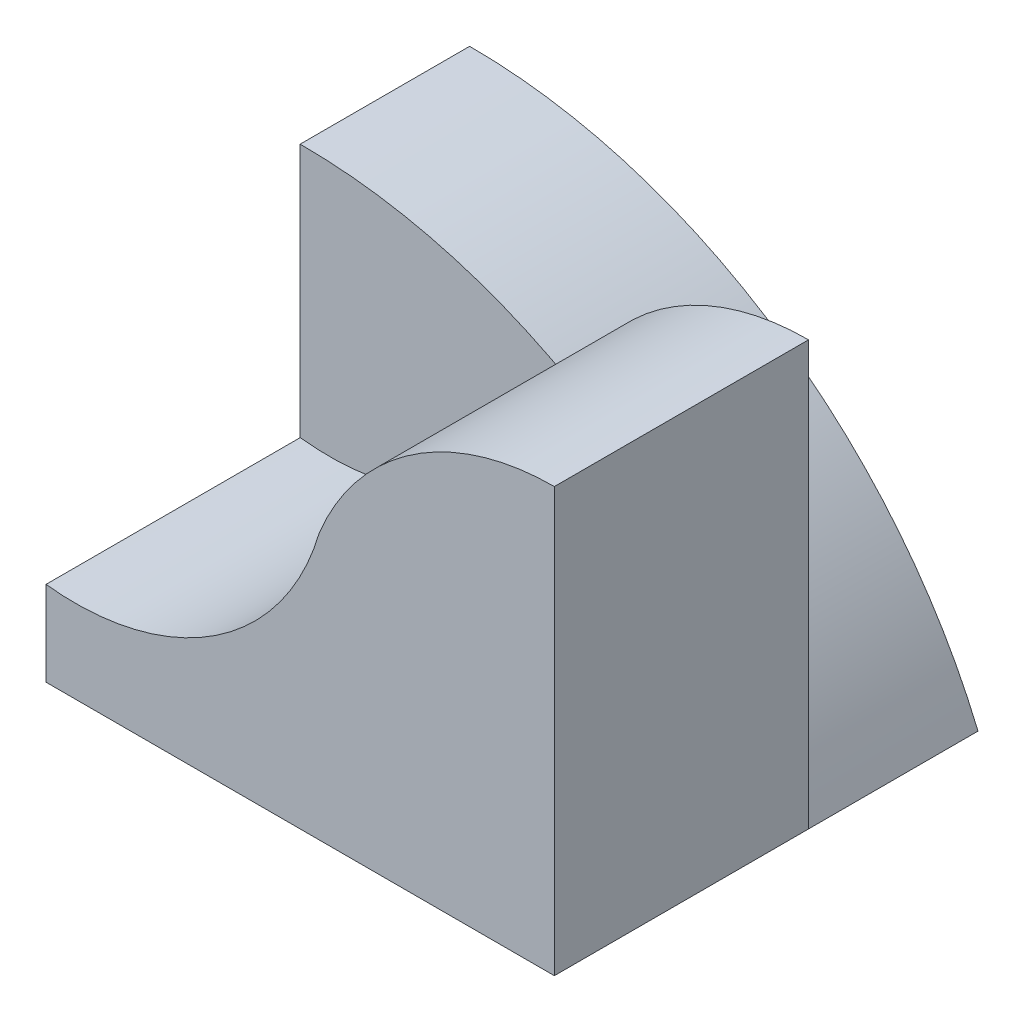
ISO-10303-21;
HEADER;
FILE_DESCRIPTION(('STEP AP214'),'2;1');
FILE_NAME('part.step','',(''),(''),'','','');
FILE_SCHEMA(('AUTOMOTIVE_DESIGN { 1 0 10303 214 1 1 1 1 }'));
ENDSEC;
DATA;
#1=APPLICATION_CONTEXT('core data for automotive mechanical design processes');
#2=APPLICATION_PROTOCOL_DEFINITION('international standard','automotive_design',2000,#1);
#3=PRODUCT_CONTEXT('',#1,'mechanical');
#4=PRODUCT('Part','Part','',(#3));
#5=PRODUCT_RELATED_PRODUCT_CATEGORY('part','',(#4));
#6=PRODUCT_DEFINITION_FORMATION('','',#4);
#7=PRODUCT_DEFINITION_CONTEXT('part definition',#1,'design');
#8=PRODUCT_DEFINITION('design','',#6,#7);
#9=PRODUCT_DEFINITION_SHAPE('','',#8);
#10=(LENGTH_UNIT() NAMED_UNIT(*) SI_UNIT(.MILLI.,.METRE.));
#11=(NAMED_UNIT(*) PLANE_ANGLE_UNIT() SI_UNIT($,.RADIAN.));
#12=(NAMED_UNIT(*) SI_UNIT($,.STERADIAN.) SOLID_ANGLE_UNIT());
#13=UNCERTAINTY_MEASURE_WITH_UNIT(LENGTH_MEASURE(1.E-05),#10,'distance_accuracy_value','');
#14=(GEOMETRIC_REPRESENTATION_CONTEXT(3) GLOBAL_UNCERTAINTY_ASSIGNED_CONTEXT((#13)) GLOBAL_UNIT_ASSIGNED_CONTEXT((#10,
#11,#12)) REPRESENTATION_CONTEXT('',''));
#15=CARTESIAN_POINT('',(0.,0.,0.));
#16=DIRECTION('',(0.,0.,1.));
#17=DIRECTION('',(1.,0.,0.));
#18=AXIS2_PLACEMENT_3D('',#15,#16,#17);
#19=CARTESIAN_POINT('',(0.,-12.5,10.));
#20=DIRECTION('',(0.,0.,-1.));
#21=DIRECTION('',(-1.,0.,0.));
#22=AXIS2_PLACEMENT_3D('',#19,#20,#21);
#23=PLANE('',#22);
#24=CARTESIAN_POINT('',(1.72698127493479,19.9002528728886,10.));
#25=DIRECTION('',(0.,0.,-1.));
#26=DIRECTION('',(-1.,0.,0.));
#27=AXIS2_PLACEMENT_3D('',#24,#25,#26);
#28=CIRCLE('',#27,15.);
#29=CARTESIAN_POINT('',(16.1310348243412,15.7141757897673,10.));
#30=VERTEX_POINT('',#29);
#31=CARTESIAN_POINT('',(0.,5.,10.));
#32=VERTEX_POINT('',#31);
#33=EDGE_CURVE('E37',#30,#32,#28,.T.);
#34=ORIENTED_EDGE('',*,*,#33,.F.);
#35=CARTESIAN_POINT('',(0.,-12.5,10.));
#36=DIRECTION('',(0.,0.,1.));
#37=DIRECTION('',(-1.,0.,0.));
#38=AXIS2_PLACEMENT_3D('',#35,#36,#37);
#39=CIRCLE('',#38,32.5);
#40=CARTESIAN_POINT('',(0.,20.,10.));
#41=VERTEX_POINT('',#40);
#42=EDGE_CURVE('E79',#30,#41,#39,.T.);
#43=ORIENTED_EDGE('',*,*,#42,.T.);
#44=DIRECTION('',(0.,-1.,0.));
#45=VECTOR('',#44,1.);
#46=CARTESIAN_POINT('',(0.,20.,10.));
#47=LINE('',#46,#45);
#48=EDGE_CURVE('E89',#41,#32,#47,.T.);
#49=ORIENTED_EDGE('',*,*,#48,.T.);
#50=EDGE_LOOP('',(#34,#43,#49));
#51=FACE_BOUND('',#50,.T.);
#52=ADVANCED_FACE('F33',(#51),#23,.F.);
#53=CARTESIAN_POINT('',(0.,-12.5,10.));
#54=DIRECTION('',(0.,0.,-1.));
#55=DIRECTION('',(-1.,0.,0.));
#56=AXIS2_PLACEMENT_3D('',#53,#54,#55);
#57=CYLINDRICAL_SURFACE('',#56,32.5);
#58=CARTESIAN_POINT('',(0.,-12.5,0.));
#59=DIRECTION('',(0.,0.,1.));
#60=DIRECTION('',(-1.,0.,0.));
#61=AXIS2_PLACEMENT_3D('',#58,#59,#60);
#62=CIRCLE('',#61,32.5);
#63=CARTESIAN_POINT('',(30.,0.,0.));
#64=VERTEX_POINT('',#63);
#65=CARTESIAN_POINT('',(0.,20.,0.));
#66=VERTEX_POINT('',#65);
#67=EDGE_CURVE('E85',#64,#66,#62,.T.);
#68=ORIENTED_EDGE('',*,*,#67,.T.);
#69=DIRECTION('',(0.,0.,-1.));
#70=VECTOR('',#69,1.);
#71=CARTESIAN_POINT('',(0.,20.,10.));
#72=LINE('',#71,#70);
#73=EDGE_CURVE('E11',#41,#66,#72,.T.);
#74=ORIENTED_EDGE('',*,*,#73,.F.);
#75=ORIENTED_EDGE('',*,*,#42,.F.);
#76=CARTESIAN_POINT('',(30.,0.,10.));
#77=VERTEX_POINT('',#76);
#78=EDGE_CURVE('E87',#77,#30,#39,.T.);
#79=ORIENTED_EDGE('',*,*,#78,.F.);
#80=DIRECTION('',(0.,0.,-1.));
#81=VECTOR('',#80,1.);
#82=CARTESIAN_POINT('',(30.,0.,10.));
#83=LINE('',#82,#81);
#84=EDGE_CURVE('E59',#77,#64,#83,.T.);
#85=ORIENTED_EDGE('',*,*,#84,.T.);
#86=EDGE_LOOP('',(#68,#74,#75,#79,#85));
#87=FACE_BOUND('',#86,.T.);
#88=ADVANCED_FACE('F35',(#87),#57,.T.);
#89=CARTESIAN_POINT('',(0.,20.,10.));
#90=DIRECTION('',(1.,0.,0.));
#91=DIRECTION('',(0.,0.,-1.));
#92=AXIS2_PLACEMENT_3D('',#89,#90,#91);
#93=PLANE('',#92);
#94=DIRECTION('',(0.,-1.,0.));
#95=VECTOR('',#94,1.);
#96=CARTESIAN_POINT('',(0.,20.,0.));
#97=LINE('',#96,#95);
#98=CARTESIAN_POINT('',(0.,0.,0.));
#99=VERTEX_POINT('',#98);
#100=EDGE_CURVE('E80',#66,#99,#97,.T.);
#101=ORIENTED_EDGE('',*,*,#100,.T.);
#102=DIRECTION('',(0.,0.,-1.));
#103=VECTOR('',#102,1.);
#104=CARTESIAN_POINT('',(0.,0.,10.));
#105=LINE('',#104,#103);
#106=CARTESIAN_POINT('',(0.,0.,25.));
#107=VERTEX_POINT('',#106);
#108=EDGE_CURVE('E43',#107,#99,#105,.T.);
#109=ORIENTED_EDGE('',*,*,#108,.F.);
#110=DIRECTION('',(0.,-1.,0.));
#111=VECTOR('',#110,1.);
#112=CARTESIAN_POINT('',(0.,5.,25.));
#113=LINE('',#112,#111);
#114=CARTESIAN_POINT('',(0.,5.,25.));
#115=VERTEX_POINT('',#114);
#116=EDGE_CURVE('E134',#115,#107,#113,.T.);
#117=ORIENTED_EDGE('',*,*,#116,.F.);
#118=DIRECTION('',(0.,0.,-1.));
#119=VECTOR('',#118,1.);
#120=CARTESIAN_POINT('',(0.,5.,25.));
#121=LINE('',#120,#119);
#122=EDGE_CURVE('E92',#115,#32,#121,.T.);
#123=ORIENTED_EDGE('',*,*,#122,.T.);
#124=ORIENTED_EDGE('',*,*,#48,.F.);
#125=ORIENTED_EDGE('',*,*,#73,.T.);
#126=EDGE_LOOP('',(#101,#109,#117,#123,#124,#125));
#127=FACE_BOUND('',#126,.T.);
#128=ADVANCED_FACE('F152',(#127),#93,.F.);
#129=CARTESIAN_POINT('',(0.,0.,10.));
#130=DIRECTION('',(0.,1.,0.));
#131=DIRECTION('',(0.,0.,1.));
#132=AXIS2_PLACEMENT_3D('',#129,#130,#131);
#133=PLANE('',#132);
#134=DIRECTION('',(1.,0.,0.));
#135=VECTOR('',#134,1.);
#136=CARTESIAN_POINT('',(0.,0.,0.));
#137=LINE('',#136,#135);
#138=EDGE_CURVE('E73',#99,#64,#137,.T.);
#139=ORIENTED_EDGE('',*,*,#138,.T.);
#140=ORIENTED_EDGE('',*,*,#84,.F.);
#141=DIRECTION('',(0.,0.,-1.));
#142=VECTOR('',#141,1.);
#143=CARTESIAN_POINT('',(30.,0.,25.));
#144=LINE('',#143,#142);
#145=CARTESIAN_POINT('',(30.,0.,25.));
#146=VERTEX_POINT('',#145);
#147=EDGE_CURVE('E96',#146,#77,#144,.T.);
#148=ORIENTED_EDGE('',*,*,#147,.F.);
#149=DIRECTION('',(1.,0.,0.));
#150=VECTOR('',#149,1.);
#151=CARTESIAN_POINT('',(0.,0.,25.));
#152=LINE('',#151,#150);
#153=EDGE_CURVE('E131',#107,#146,#152,.T.);
#154=ORIENTED_EDGE('',*,*,#153,.F.);
#155=ORIENTED_EDGE('',*,*,#108,.T.);
#156=EDGE_LOOP('',(#139,#140,#148,#154,#155));
#157=FACE_BOUND('',#156,.T.);
#158=ADVANCED_FACE('F74',(#157),#133,.F.);
#159=CARTESIAN_POINT('',(0.,-12.5,0.));
#160=DIRECTION('',(0.,0.,-1.));
#161=DIRECTION('',(-1.,0.,0.));
#162=AXIS2_PLACEMENT_3D('',#159,#160,#161);
#163=PLANE('',#162);
#164=ORIENTED_EDGE('',*,*,#67,.F.);
#165=ORIENTED_EDGE('',*,*,#138,.F.);
#166=ORIENTED_EDGE('',*,*,#100,.F.);
#167=EDGE_LOOP('',(#164,#165,#166));
#168=FACE_BOUND('',#167,.T.);
#169=ADVANCED_FACE('F91',(#168),#163,.T.);
#170=CARTESIAN_POINT('',(1.72698127493479,19.9002528728886,25.));
#171=DIRECTION('',(0.,0.,-1.));
#172=DIRECTION('',(-1.,0.,0.));
#173=AXIS2_PLACEMENT_3D('',#170,#171,#172);
#174=CYLINDRICAL_SURFACE('',#173,15.);
#175=ORIENTED_EDGE('',*,*,#33,.T.);
#176=ORIENTED_EDGE('',*,*,#122,.F.);
#177=CARTESIAN_POINT('',(1.72698127493479,19.9002528728886,25.));
#178=DIRECTION('',(0.,0.,-1.));
#179=DIRECTION('',(-1.,0.,0.));
#180=AXIS2_PLACEMENT_3D('',#177,#178,#179);
#181=CIRCLE('',#180,15.);
#182=CARTESIAN_POINT('',(16.1310348243412,15.7141757897673,25.));
#183=VERTEX_POINT('',#182);
#184=EDGE_CURVE('E121',#183,#115,#181,.T.);
#185=ORIENTED_EDGE('',*,*,#184,.F.);
#186=DIRECTION('',(0.,0.,-1.));
#187=VECTOR('',#186,1.);
#188=CARTESIAN_POINT('',(16.1310348243412,15.7141757897673,25.));
#189=LINE('',#188,#187);
#190=EDGE_CURVE('E115',#183,#30,#189,.T.);
#191=ORIENTED_EDGE('',*,*,#190,.T.);
#192=EDGE_LOOP('',(#175,#176,#185,#191));
#193=FACE_BOUND('',#192,.T.);
#194=ADVANCED_FACE('F150',(#193),#174,.F.);
#195=CARTESIAN_POINT('',(30.,0.,25.));
#196=DIRECTION('',(-1.,0.,0.));
#197=DIRECTION('',(0.,0.,1.));
#198=AXIS2_PLACEMENT_3D('',#195,#196,#197);
#199=PLANE('',#198);
#200=DIRECTION('',(0.,1.,0.));
#201=VECTOR('',#200,1.);
#202=CARTESIAN_POINT('',(30.,0.,10.));
#203=LINE('',#202,#201);
#204=CARTESIAN_POINT('',(30.,25.,10.));
#205=VERTEX_POINT('',#204);
#206=EDGE_CURVE('E122',#77,#205,#203,.T.);
#207=ORIENTED_EDGE('',*,*,#206,.T.);
#208=DIRECTION('',(0.,0.,-1.));
#209=VECTOR('',#208,1.);
#210=CARTESIAN_POINT('',(30.,25.,25.));
#211=LINE('',#210,#209);
#212=CARTESIAN_POINT('',(30.,25.,25.));
#213=VERTEX_POINT('',#212);
#214=EDGE_CURVE('E112',#213,#205,#211,.T.);
#215=ORIENTED_EDGE('',*,*,#214,.F.);
#216=DIRECTION('',(0.,1.,0.));
#217=VECTOR('',#216,1.);
#218=CARTESIAN_POINT('',(30.,0.,25.));
#219=LINE('',#218,#217);
#220=EDGE_CURVE('E128',#146,#213,#219,.T.);
#221=ORIENTED_EDGE('',*,*,#220,.F.);
#222=ORIENTED_EDGE('',*,*,#147,.T.);
#223=EDGE_LOOP('',(#207,#215,#221,#222));
#224=FACE_BOUND('',#223,.T.);
#225=ADVANCED_FACE('F190',(#224),#199,.F.);
#226=CARTESIAN_POINT('',(30.,10.,25.));
#227=DIRECTION('',(0.,0.,-1.));
#228=DIRECTION('',(-1.,0.,0.));
#229=AXIS2_PLACEMENT_3D('',#226,#227,#228);
#230=CYLINDRICAL_SURFACE('',#229,15.);
#231=CARTESIAN_POINT('',(30.,10.,10.));
#232=DIRECTION('',(0.,0.,1.));
#233=DIRECTION('',(1.,0.,0.));
#234=AXIS2_PLACEMENT_3D('',#231,#232,#233);
#235=CIRCLE('',#234,15.);
#236=EDGE_CURVE('E119',#205,#30,#235,.T.);
#237=ORIENTED_EDGE('',*,*,#236,.T.);
#238=ORIENTED_EDGE('',*,*,#190,.F.);
#239=CARTESIAN_POINT('',(30.,10.,25.));
#240=DIRECTION('',(0.,0.,1.));
#241=DIRECTION('',(1.,0.,0.));
#242=AXIS2_PLACEMENT_3D('',#239,#240,#241);
#243=CIRCLE('',#242,15.);
#244=EDGE_CURVE('E118',#213,#183,#243,.T.);
#245=ORIENTED_EDGE('',*,*,#244,.F.);
#246=ORIENTED_EDGE('',*,*,#214,.T.);
#247=EDGE_LOOP('',(#237,#238,#245,#246));
#248=FACE_BOUND('',#247,.T.);
#249=ADVANCED_FACE('F196',(#248),#230,.T.);
#250=CARTESIAN_POINT('',(1.72698127493479,19.9002528728886,25.));
#251=DIRECTION('',(0.,0.,-1.));
#252=DIRECTION('',(-1.,0.,0.));
#253=AXIS2_PLACEMENT_3D('',#250,#251,#252);
#254=PLANE('',#253);
#255=ORIENTED_EDGE('',*,*,#184,.T.);
#256=ORIENTED_EDGE('',*,*,#116,.T.);
#257=ORIENTED_EDGE('',*,*,#153,.T.);
#258=ORIENTED_EDGE('',*,*,#220,.T.);
#259=ORIENTED_EDGE('',*,*,#244,.T.);
#260=EDGE_LOOP('',(#255,#256,#257,#258,#259));
#261=FACE_BOUND('',#260,.T.);
#262=ADVANCED_FACE('F142',(#261),#254,.F.);
#263=CARTESIAN_POINT('',(1.72698127493479,19.9002528728886,10.));
#264=DIRECTION('',(0.,0.,-1.));
#265=DIRECTION('',(-1.,0.,0.));
#266=AXIS2_PLACEMENT_3D('',#263,#264,#265);
#267=PLANE('',#266);
#268=ORIENTED_EDGE('',*,*,#206,.F.);
#269=ORIENTED_EDGE('',*,*,#78,.T.);
#270=ORIENTED_EDGE('',*,*,#236,.F.);
#271=EDGE_LOOP('',(#268,#269,#270));
#272=FACE_BOUND('',#271,.T.);
#273=ADVANCED_FACE('F210',(#272),#267,.T.);
#274=CLOSED_SHELL('',(#52,#88,#128,#158,#169,#194,#225,#249,#262,#273));
#275=MANIFOLD_SOLID_BREP('B2',#274);
#276=ADVANCED_BREP_SHAPE_REPRESENTATION('',(#18,#275),#14);
#277=SHAPE_DEFINITION_REPRESENTATION(#9,#276);
ENDSEC;
END-ISO-10303-21;
